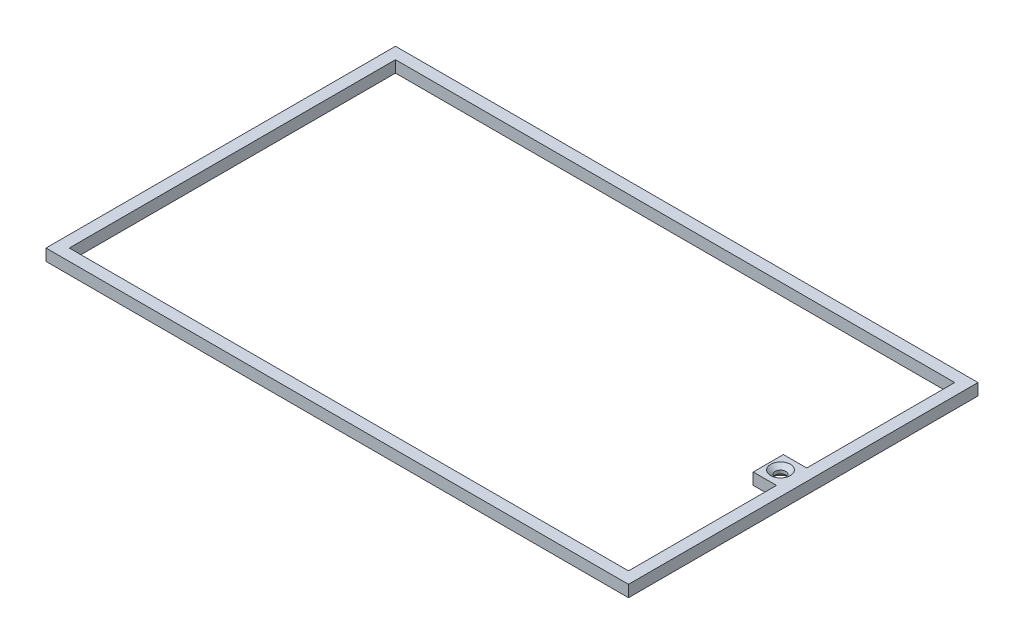
ISO-10303-21;
HEADER;
FILE_DESCRIPTION(('STEP AP214'),'2;1');
FILE_NAME('part.step','',(''),(''),'','','');
FILE_SCHEMA(('AUTOMOTIVE_DESIGN { 1 0 10303 214 1 1 1 1 }'));
ENDSEC;
DATA;
#1=APPLICATION_CONTEXT('core data for automotive mechanical design processes');
#2=APPLICATION_PROTOCOL_DEFINITION('international standard','automotive_design',2000,#1);
#3=PRODUCT_CONTEXT('',#1,'mechanical');
#4=PRODUCT('Part','Part','',(#3));
#5=PRODUCT_RELATED_PRODUCT_CATEGORY('part','',(#4));
#6=PRODUCT_DEFINITION_FORMATION('','',#4);
#7=PRODUCT_DEFINITION_CONTEXT('part definition',#1,'design');
#8=PRODUCT_DEFINITION('design','',#6,#7);
#9=PRODUCT_DEFINITION_SHAPE('','',#8);
#10=(LENGTH_UNIT() NAMED_UNIT(*) SI_UNIT(.MILLI.,.METRE.));
#11=(NAMED_UNIT(*) PLANE_ANGLE_UNIT() SI_UNIT($,.RADIAN.));
#12=(NAMED_UNIT(*) SI_UNIT($,.STERADIAN.) SOLID_ANGLE_UNIT());
#13=UNCERTAINTY_MEASURE_WITH_UNIT(LENGTH_MEASURE(1.E-05),#10,'distance_accuracy_value','');
#14=(GEOMETRIC_REPRESENTATION_CONTEXT(3) GLOBAL_UNCERTAINTY_ASSIGNED_CONTEXT((#13)) GLOBAL_UNIT_ASSIGNED_CONTEXT((#10,
#11,#12)) REPRESENTATION_CONTEXT('',''));
#15=CARTESIAN_POINT('',(0.,0.,0.));
#16=DIRECTION('',(0.,0.,1.));
#17=DIRECTION('',(1.,0.,0.));
#18=AXIS2_PLACEMENT_3D('',#15,#16,#17);
#19=CARTESIAN_POINT('',(0.,0.,0.));
#20=DIRECTION('',(0.,-1.,0.));
#21=DIRECTION('',(0.,0.,-1.));
#22=AXIS2_PLACEMENT_3D('',#19,#20,#21);
#23=PLANE('',#22);
#24=CARTESIAN_POINT('',(240.110859840816,0.,-75.1359923408761));
#25=DIRECTION('',(0.,-1.,0.));
#26=DIRECTION('',(0.,0.,-1.));
#27=AXIS2_PLACEMENT_3D('',#24,#25,#26);
#28=CIRCLE('',#27,4.24789999999994);
#29=CARTESIAN_POINT('',(240.110859840816,0.,-79.383892340876));
#30=VERTEX_POINT('',#29);
#31=EDGE_CURVE('E43',#30,#30,#28,.F.);
#32=ORIENTED_EDGE('',*,*,#31,.T.);
#33=EDGE_LOOP('',(#32));
#34=FACE_BOUND('',#33,.T.);
#35=DIRECTION('',(0.,0.,1.));
#36=VECTOR('',#35,1.);
#37=CARTESIAN_POINT('',(0.,0.,0.));
#38=LINE('',#37,#36);
#39=CARTESIAN_POINT('',(0.,0.,-150.));
#40=VERTEX_POINT('',#39);
#41=CARTESIAN_POINT('',(0.,0.,0.));
#42=VERTEX_POINT('',#41);
#43=EDGE_CURVE('E182',#40,#42,#38,.T.);
#44=ORIENTED_EDGE('',*,*,#43,.F.);
#45=DIRECTION('',(-1.,0.,0.));
#46=VECTOR('',#45,1.);
#47=CARTESIAN_POINT('',(0.,0.,-150.));
#48=LINE('',#47,#46);
#49=CARTESIAN_POINT('',(250.,0.,-150.));
#50=VERTEX_POINT('',#49);
#51=EDGE_CURVE('E198',#50,#40,#48,.T.);
#52=ORIENTED_EDGE('',*,*,#51,.F.);
#53=DIRECTION('',(0.,0.,-1.));
#54=VECTOR('',#53,1.);
#55=CARTESIAN_POINT('',(250.,0.,0.));
#56=LINE('',#55,#54);
#57=CARTESIAN_POINT('',(250.,0.,0.));
#58=VERTEX_POINT('',#57);
#59=EDGE_CURVE('E209',#58,#50,#56,.T.);
#60=ORIENTED_EDGE('',*,*,#59,.F.);
#61=DIRECTION('',(1.,0.,0.));
#62=VECTOR('',#61,1.);
#63=CARTESIAN_POINT('',(0.,0.,0.));
#64=LINE('',#63,#62);
#65=EDGE_CURVE('E207',#42,#58,#64,.T.);
#66=ORIENTED_EDGE('',*,*,#65,.F.);
#67=EDGE_LOOP('',(#44,#52,#60,#66));
#68=FACE_BOUND('',#67,.T.);
#69=DIRECTION('',(0.,0.,1.));
#70=VECTOR('',#69,1.);
#71=CARTESIAN_POINT('',(5.00000000000001,0.,-5.));
#72=LINE('',#71,#70);
#73=CARTESIAN_POINT('',(4.99999999999999,0.,-145.));
#74=VERTEX_POINT('',#73);
#75=CARTESIAN_POINT('',(5.00000000000001,0.,-5.));
#76=VERTEX_POINT('',#75);
#77=EDGE_CURVE('E126',#74,#76,#72,.T.);
#78=ORIENTED_EDGE('',*,*,#77,.T.);
#79=DIRECTION('',(1.,0.,0.));
#80=VECTOR('',#79,1.);
#81=CARTESIAN_POINT('',(5.00000000000001,0.,-5.));
#82=LINE('',#81,#80);
#83=CARTESIAN_POINT('',(245.,0.,-5.));
#84=VERTEX_POINT('',#83);
#85=EDGE_CURVE('E135',#76,#84,#82,.T.);
#86=ORIENTED_EDGE('',*,*,#85,.T.);
#87=DIRECTION('',(0.,0.,-1.));
#88=VECTOR('',#87,1.);
#89=CARTESIAN_POINT('',(245.,0.,-5.));
#90=LINE('',#89,#88);
#91=CARTESIAN_POINT('',(245.,0.,-68.5227089212575));
#92=VERTEX_POINT('',#91);
#93=EDGE_CURVE('E58',#84,#92,#90,.T.);
#94=ORIENTED_EDGE('',*,*,#93,.T.);
#95=DIRECTION('',(-1.,0.,0.));
#96=VECTOR('',#95,1.);
#97=CARTESIAN_POINT('',(235.,0.,-68.5227089212575));
#98=LINE('',#97,#96);
#99=CARTESIAN_POINT('',(235.,0.,-68.5227089212575));
#100=VERTEX_POINT('',#99);
#101=EDGE_CURVE('E151',#92,#100,#98,.T.);
#102=ORIENTED_EDGE('',*,*,#101,.T.);
#103=DIRECTION('',(0.,0.,-1.));
#104=VECTOR('',#103,1.);
#105=CARTESIAN_POINT('',(235.,0.,-81.4772910787425));
#106=LINE('',#105,#104);
#107=CARTESIAN_POINT('',(235.,0.,-81.4772910787425));
#108=VERTEX_POINT('',#107);
#109=EDGE_CURVE('E154',#100,#108,#106,.T.);
#110=ORIENTED_EDGE('',*,*,#109,.T.);
#111=DIRECTION('',(1.,0.,0.));
#112=VECTOR('',#111,1.);
#113=CARTESIAN_POINT('',(235.,0.,-81.4772910787425));
#114=LINE('',#113,#112);
#115=CARTESIAN_POINT('',(245.,0.,-81.4772910787425));
#116=VERTEX_POINT('',#115);
#117=EDGE_CURVE('E157',#108,#116,#114,.T.);
#118=ORIENTED_EDGE('',*,*,#117,.T.);
#119=DIRECTION('',(0.,0.,-1.));
#120=VECTOR('',#119,1.);
#121=CARTESIAN_POINT('',(245.,0.,-81.4772910787425));
#122=LINE('',#121,#120);
#123=CARTESIAN_POINT('',(245.,0.,-145.));
#124=VERTEX_POINT('',#123);
#125=EDGE_CURVE('E160',#116,#124,#122,.T.);
#126=ORIENTED_EDGE('',*,*,#125,.T.);
#127=DIRECTION('',(-1.,0.,0.));
#128=VECTOR('',#127,1.);
#129=CARTESIAN_POINT('',(4.99999999999999,0.,-145.));
#130=LINE('',#129,#128);
#131=EDGE_CURVE('E132',#124,#74,#130,.T.);
#132=ORIENTED_EDGE('',*,*,#131,.T.);
#133=EDGE_LOOP('',(#78,#86,#94,#102,#110,#118,#126,#132));
#134=FACE_BOUND('',#133,.T.);
#135=ADVANCED_FACE('F35',(#34,#68,#134),#23,.T.);
#136=CARTESIAN_POINT('',(0.,5.,0.));
#137=DIRECTION('',(0.,-1.,0.));
#138=DIRECTION('',(0.,0.,-1.));
#139=AXIS2_PLACEMENT_3D('',#136,#137,#138);
#140=PLANE('',#139);
#141=DIRECTION('',(1.,0.,0.));
#142=VECTOR('',#141,1.);
#143=CARTESIAN_POINT('',(5.00000000000001,5.,-5.));
#144=LINE('',#143,#142);
#145=CARTESIAN_POINT('',(5.00000000000001,5.,-5.));
#146=VERTEX_POINT('',#145);
#147=CARTESIAN_POINT('',(245.,5.,-5.));
#148=VERTEX_POINT('',#147);
#149=EDGE_CURVE('E164',#146,#148,#144,.T.);
#150=ORIENTED_EDGE('',*,*,#149,.F.);
#151=DIRECTION('',(0.,0.,1.));
#152=VECTOR('',#151,1.);
#153=CARTESIAN_POINT('',(5.00000000000001,5.,-5.));
#154=LINE('',#153,#152);
#155=CARTESIAN_POINT('',(4.99999999999999,5.,-145.));
#156=VERTEX_POINT('',#155);
#157=EDGE_CURVE('E50',#156,#146,#154,.T.);
#158=ORIENTED_EDGE('',*,*,#157,.F.);
#159=DIRECTION('',(-1.,0.,0.));
#160=VECTOR('',#159,1.);
#161=CARTESIAN_POINT('',(4.99999999999999,5.,-145.));
#162=LINE('',#161,#160);
#163=CARTESIAN_POINT('',(245.,5.,-145.));
#164=VERTEX_POINT('',#163);
#165=EDGE_CURVE('E141',#164,#156,#162,.T.);
#166=ORIENTED_EDGE('',*,*,#165,.F.);
#167=DIRECTION('',(0.,0.,-1.));
#168=VECTOR('',#167,1.);
#169=CARTESIAN_POINT('',(245.,5.,-81.4772910787425));
#170=LINE('',#169,#168);
#171=CARTESIAN_POINT('',(245.,5.,-81.4772910787425));
#172=VERTEX_POINT('',#171);
#173=EDGE_CURVE('E144',#172,#164,#170,.T.);
#174=ORIENTED_EDGE('',*,*,#173,.F.);
#175=DIRECTION('',(1.,0.,0.));
#176=VECTOR('',#175,1.);
#177=CARTESIAN_POINT('',(235.,5.,-81.4772910787425));
#178=LINE('',#177,#176);
#179=CARTESIAN_POINT('',(235.,5.,-81.4772910787425));
#180=VERTEX_POINT('',#179);
#181=EDGE_CURVE('E175',#180,#172,#178,.T.);
#182=ORIENTED_EDGE('',*,*,#181,.F.);
#183=DIRECTION('',(0.,0.,-1.));
#184=VECTOR('',#183,1.);
#185=CARTESIAN_POINT('',(235.,5.,-81.4772910787425));
#186=LINE('',#185,#184);
#187=CARTESIAN_POINT('',(235.,5.,-68.5227089212575));
#188=VERTEX_POINT('',#187);
#189=EDGE_CURVE('E172',#188,#180,#186,.T.);
#190=ORIENTED_EDGE('',*,*,#189,.F.);
#191=DIRECTION('',(-1.,0.,0.));
#192=VECTOR('',#191,1.);
#193=CARTESIAN_POINT('',(235.,5.,-68.5227089212575));
#194=LINE('',#193,#192);
#195=CARTESIAN_POINT('',(245.,5.,-68.5227089212575));
#196=VERTEX_POINT('',#195);
#197=EDGE_CURVE('E169',#196,#188,#194,.T.);
#198=ORIENTED_EDGE('',*,*,#197,.F.);
#199=DIRECTION('',(0.,0.,-1.));
#200=VECTOR('',#199,1.);
#201=CARTESIAN_POINT('',(245.,5.,-5.));
#202=LINE('',#201,#200);
#203=EDGE_CURVE('E166',#148,#196,#202,.T.);
#204=ORIENTED_EDGE('',*,*,#203,.F.);
#205=EDGE_LOOP('',(#150,#158,#166,#174,#182,#190,#198,#204));
#206=FACE_BOUND('',#205,.T.);
#207=DIRECTION('',(0.,0.,1.));
#208=VECTOR('',#207,1.);
#209=CARTESIAN_POINT('',(0.,5.,0.));
#210=LINE('',#209,#208);
#211=CARTESIAN_POINT('',(0.,5.,-150.));
#212=VERTEX_POINT('',#211);
#213=CARTESIAN_POINT('',(0.,5.,0.));
#214=VERTEX_POINT('',#213);
#215=EDGE_CURVE('E194',#212,#214,#210,.T.);
#216=ORIENTED_EDGE('',*,*,#215,.T.);
#217=DIRECTION('',(1.,0.,0.));
#218=VECTOR('',#217,1.);
#219=CARTESIAN_POINT('',(0.,5.,0.));
#220=LINE('',#219,#218);
#221=CARTESIAN_POINT('',(250.,5.,0.));
#222=VERTEX_POINT('',#221);
#223=EDGE_CURVE('E197',#214,#222,#220,.T.);
#224=ORIENTED_EDGE('',*,*,#223,.T.);
#225=DIRECTION('',(0.,0.,-1.));
#226=VECTOR('',#225,1.);
#227=CARTESIAN_POINT('',(250.,5.,0.));
#228=LINE('',#227,#226);
#229=CARTESIAN_POINT('',(250.,5.,-150.));
#230=VERTEX_POINT('',#229);
#231=EDGE_CURVE('E200',#222,#230,#228,.T.);
#232=ORIENTED_EDGE('',*,*,#231,.T.);
#233=DIRECTION('',(-1.,0.,0.));
#234=VECTOR('',#233,1.);
#235=CARTESIAN_POINT('',(0.,5.,-150.));
#236=LINE('',#235,#234);
#237=EDGE_CURVE('E202',#230,#212,#236,.T.);
#238=ORIENTED_EDGE('',*,*,#237,.T.);
#239=EDGE_LOOP('',(#216,#224,#232,#238));
#240=FACE_BOUND('',#239,.T.);
#241=CARTESIAN_POINT('',(240.110859840816,5.,-75.1359923408761));
#242=DIRECTION('',(0.,1.,0.));
#243=DIRECTION('',(0.,0.,1.));
#244=AXIS2_PLACEMENT_3D('',#241,#242,#243);
#245=CIRCLE('',#244,4.21640000000001);
#246=CARTESIAN_POINT('',(240.110859840816,5.,-70.9195923408761));
#247=VERTEX_POINT('',#246);
#248=EDGE_CURVE('E279',#247,#247,#245,.T.);
#249=ORIENTED_EDGE('',*,*,#248,.F.);
#250=EDGE_LOOP('',(#249));
#251=FACE_BOUND('',#250,.T.);
#252=ADVANCED_FACE('F238',(#206,#240,#251),#140,.F.);
#253=CARTESIAN_POINT('',(0.,5.,0.));
#254=DIRECTION('',(1.,0.,0.));
#255=DIRECTION('',(0.,0.,-1.));
#256=AXIS2_PLACEMENT_3D('',#253,#254,#255);
#257=PLANE('',#256);
#258=ORIENTED_EDGE('',*,*,#43,.T.);
#259=DIRECTION('',(0.,-1.,0.));
#260=VECTOR('',#259,1.);
#261=CARTESIAN_POINT('',(0.,5.,0.));
#262=LINE('',#261,#260);
#263=EDGE_CURVE('E220',#214,#42,#262,.T.);
#264=ORIENTED_EDGE('',*,*,#263,.F.);
#265=ORIENTED_EDGE('',*,*,#215,.F.);
#266=DIRECTION('',(0.,-1.,0.));
#267=VECTOR('',#266,1.);
#268=CARTESIAN_POINT('',(0.,5.,-150.));
#269=LINE('',#268,#267);
#270=EDGE_CURVE('E204',#212,#40,#269,.T.);
#271=ORIENTED_EDGE('',*,*,#270,.T.);
#272=EDGE_LOOP('',(#258,#264,#265,#271));
#273=FACE_BOUND('',#272,.T.);
#274=ADVANCED_FACE('F245',(#273),#257,.F.);
#275=CARTESIAN_POINT('',(0.,5.,0.));
#276=DIRECTION('',(0.,0.,-1.));
#277=DIRECTION('',(-1.,0.,0.));
#278=AXIS2_PLACEMENT_3D('',#275,#276,#277);
#279=PLANE('',#278);
#280=ORIENTED_EDGE('',*,*,#65,.T.);
#281=DIRECTION('',(0.,-1.,0.));
#282=VECTOR('',#281,1.);
#283=CARTESIAN_POINT('',(250.,5.,0.));
#284=LINE('',#283,#282);
#285=EDGE_CURVE('E217',#222,#58,#284,.T.);
#286=ORIENTED_EDGE('',*,*,#285,.F.);
#287=ORIENTED_EDGE('',*,*,#223,.F.);
#288=ORIENTED_EDGE('',*,*,#263,.T.);
#289=EDGE_LOOP('',(#280,#286,#287,#288));
#290=FACE_BOUND('',#289,.T.);
#291=ADVANCED_FACE('F257',(#290),#279,.F.);
#292=CARTESIAN_POINT('',(250.,5.,0.));
#293=DIRECTION('',(-1.,0.,0.));
#294=DIRECTION('',(0.,0.,1.));
#295=AXIS2_PLACEMENT_3D('',#292,#293,#294);
#296=PLANE('',#295);
#297=ORIENTED_EDGE('',*,*,#59,.T.);
#298=DIRECTION('',(0.,-1.,0.));
#299=VECTOR('',#298,1.);
#300=CARTESIAN_POINT('',(250.,5.,-150.));
#301=LINE('',#300,#299);
#302=EDGE_CURVE('E214',#230,#50,#301,.T.);
#303=ORIENTED_EDGE('',*,*,#302,.F.);
#304=ORIENTED_EDGE('',*,*,#231,.F.);
#305=ORIENTED_EDGE('',*,*,#285,.T.);
#306=EDGE_LOOP('',(#297,#303,#304,#305));
#307=FACE_BOUND('',#306,.T.);
#308=ADVANCED_FACE('F253',(#307),#296,.F.);
#309=CARTESIAN_POINT('',(0.,5.,-150.));
#310=DIRECTION('',(0.,0.,1.));
#311=DIRECTION('',(1.,0.,0.));
#312=AXIS2_PLACEMENT_3D('',#309,#310,#311);
#313=PLANE('',#312);
#314=ORIENTED_EDGE('',*,*,#51,.T.);
#315=ORIENTED_EDGE('',*,*,#270,.F.);
#316=ORIENTED_EDGE('',*,*,#237,.F.);
#317=ORIENTED_EDGE('',*,*,#302,.T.);
#318=EDGE_LOOP('',(#314,#315,#316,#317));
#319=FACE_BOUND('',#318,.T.);
#320=ADVANCED_FACE('F250',(#319),#313,.F.);
#321=CARTESIAN_POINT('',(5.00000000000001,0.,-5.));
#322=DIRECTION('',(-1.,0.,0.));
#323=DIRECTION('',(0.,0.,1.));
#324=AXIS2_PLACEMENT_3D('',#321,#322,#323);
#325=PLANE('',#324);
#326=ORIENTED_EDGE('',*,*,#157,.T.);
#327=DIRECTION('',(0.,1.,0.));
#328=VECTOR('',#327,1.);
#329=CARTESIAN_POINT('',(5.00000000000001,0.,-5.));
#330=LINE('',#329,#328);
#331=EDGE_CURVE('E122',#76,#146,#330,.T.);
#332=ORIENTED_EDGE('',*,*,#331,.F.);
#333=ORIENTED_EDGE('',*,*,#77,.F.);
#334=DIRECTION('',(0.,1.,0.));
#335=VECTOR('',#334,1.);
#336=CARTESIAN_POINT('',(4.99999999999999,0.,-145.));
#337=LINE('',#336,#335);
#338=EDGE_CURVE('E180',#74,#156,#337,.T.);
#339=ORIENTED_EDGE('',*,*,#338,.T.);
#340=EDGE_LOOP('',(#326,#332,#333,#339));
#341=FACE_BOUND('',#340,.T.);
#342=ADVANCED_FACE('F124',(#341),#325,.F.);
#343=CARTESIAN_POINT('',(4.99999999999999,0.,-145.));
#344=DIRECTION('',(0.,0.,-1.));
#345=DIRECTION('',(-1.,0.,0.));
#346=AXIS2_PLACEMENT_3D('',#343,#344,#345);
#347=PLANE('',#346);
#348=ORIENTED_EDGE('',*,*,#165,.T.);
#349=ORIENTED_EDGE('',*,*,#338,.F.);
#350=ORIENTED_EDGE('',*,*,#131,.F.);
#351=DIRECTION('',(0.,1.,0.));
#352=VECTOR('',#351,1.);
#353=CARTESIAN_POINT('',(245.,0.,-145.));
#354=LINE('',#353,#352);
#355=EDGE_CURVE('E183',#124,#164,#354,.T.);
#356=ORIENTED_EDGE('',*,*,#355,.T.);
#357=EDGE_LOOP('',(#348,#349,#350,#356));
#358=FACE_BOUND('',#357,.T.);
#359=ADVANCED_FACE('F292',(#358),#347,.F.);
#360=CARTESIAN_POINT('',(245.,0.,-81.4772910787425));
#361=DIRECTION('',(1.,0.,0.));
#362=DIRECTION('',(0.,0.,-1.));
#363=AXIS2_PLACEMENT_3D('',#360,#361,#362);
#364=PLANE('',#363);
#365=ORIENTED_EDGE('',*,*,#173,.T.);
#366=ORIENTED_EDGE('',*,*,#355,.F.);
#367=ORIENTED_EDGE('',*,*,#125,.F.);
#368=DIRECTION('',(0.,1.,0.));
#369=VECTOR('',#368,1.);
#370=CARTESIAN_POINT('',(245.,0.,-81.4772910787425));
#371=LINE('',#370,#369);
#372=EDGE_CURVE('E185',#116,#172,#371,.T.);
#373=ORIENTED_EDGE('',*,*,#372,.T.);
#374=EDGE_LOOP('',(#365,#366,#367,#373));
#375=FACE_BOUND('',#374,.T.);
#376=ADVANCED_FACE('F295',(#375),#364,.F.);
#377=CARTESIAN_POINT('',(235.,0.,-81.4772910787425));
#378=DIRECTION('',(0.,0.,1.));
#379=DIRECTION('',(1.,0.,0.));
#380=AXIS2_PLACEMENT_3D('',#377,#378,#379);
#381=PLANE('',#380);
#382=ORIENTED_EDGE('',*,*,#181,.T.);
#383=ORIENTED_EDGE('',*,*,#372,.F.);
#384=ORIENTED_EDGE('',*,*,#117,.F.);
#385=DIRECTION('',(0.,1.,0.));
#386=VECTOR('',#385,1.);
#387=CARTESIAN_POINT('',(235.,0.,-81.4772910787425));
#388=LINE('',#387,#386);
#389=EDGE_CURVE('E187',#108,#180,#388,.T.);
#390=ORIENTED_EDGE('',*,*,#389,.T.);
#391=EDGE_LOOP('',(#382,#383,#384,#390));
#392=FACE_BOUND('',#391,.T.);
#393=ADVANCED_FACE('F299',(#392),#381,.F.);
#394=CARTESIAN_POINT('',(235.,0.,-81.4772910787425));
#395=DIRECTION('',(1.,0.,0.));
#396=DIRECTION('',(0.,0.,-1.));
#397=AXIS2_PLACEMENT_3D('',#394,#395,#396);
#398=PLANE('',#397);
#399=ORIENTED_EDGE('',*,*,#189,.T.);
#400=ORIENTED_EDGE('',*,*,#389,.F.);
#401=ORIENTED_EDGE('',*,*,#109,.F.);
#402=DIRECTION('',(0.,1.,0.));
#403=VECTOR('',#402,1.);
#404=CARTESIAN_POINT('',(235.,0.,-68.5227089212575));
#405=LINE('',#404,#403);
#406=EDGE_CURVE('E189',#100,#188,#405,.T.);
#407=ORIENTED_EDGE('',*,*,#406,.T.);
#408=EDGE_LOOP('',(#399,#400,#401,#407));
#409=FACE_BOUND('',#408,.T.);
#410=ADVANCED_FACE('F303',(#409),#398,.F.);
#411=CARTESIAN_POINT('',(235.,0.,-68.5227089212575));
#412=DIRECTION('',(0.,0.,-1.));
#413=DIRECTION('',(-1.,0.,0.));
#414=AXIS2_PLACEMENT_3D('',#411,#412,#413);
#415=PLANE('',#414);
#416=ORIENTED_EDGE('',*,*,#197,.T.);
#417=ORIENTED_EDGE('',*,*,#406,.F.);
#418=ORIENTED_EDGE('',*,*,#101,.F.);
#419=DIRECTION('',(0.,1.,0.));
#420=VECTOR('',#419,1.);
#421=CARTESIAN_POINT('',(245.,0.,-68.5227089212575));
#422=LINE('',#421,#420);
#423=EDGE_CURVE('E191',#92,#196,#422,.T.);
#424=ORIENTED_EDGE('',*,*,#423,.T.);
#425=EDGE_LOOP('',(#416,#417,#418,#424));
#426=FACE_BOUND('',#425,.T.);
#427=ADVANCED_FACE('F307',(#426),#415,.F.);
#428=CARTESIAN_POINT('',(245.,0.,-5.));
#429=DIRECTION('',(1.,0.,0.));
#430=DIRECTION('',(0.,0.,-1.));
#431=AXIS2_PLACEMENT_3D('',#428,#429,#430);
#432=PLANE('',#431);
#433=ORIENTED_EDGE('',*,*,#203,.T.);
#434=ORIENTED_EDGE('',*,*,#423,.F.);
#435=ORIENTED_EDGE('',*,*,#93,.F.);
#436=DIRECTION('',(0.,1.,0.));
#437=VECTOR('',#436,1.);
#438=CARTESIAN_POINT('',(245.,0.,-5.));
#439=LINE('',#438,#437);
#440=EDGE_CURVE('E131',#84,#148,#439,.T.);
#441=ORIENTED_EDGE('',*,*,#440,.T.);
#442=EDGE_LOOP('',(#433,#434,#435,#441));
#443=FACE_BOUND('',#442,.T.);
#444=ADVANCED_FACE('F289',(#443),#432,.F.);
#445=CARTESIAN_POINT('',(5.00000000000001,0.,-5.));
#446=DIRECTION('',(0.,0.,1.));
#447=DIRECTION('',(1.,0.,0.));
#448=AXIS2_PLACEMENT_3D('',#445,#446,#447);
#449=PLANE('',#448);
#450=ORIENTED_EDGE('',*,*,#149,.T.);
#451=ORIENTED_EDGE('',*,*,#440,.F.);
#452=ORIENTED_EDGE('',*,*,#85,.F.);
#453=ORIENTED_EDGE('',*,*,#331,.T.);
#454=EDGE_LOOP('',(#450,#451,#452,#453));
#455=FACE_BOUND('',#454,.T.);
#456=ADVANCED_FACE('F136',(#455),#449,.F.);
#457=CARTESIAN_POINT('',(240.110859840816,5.,-75.1359923408761));
#458=DIRECTION('',(0.,1.,0.));
#459=DIRECTION('',(0.,0.,1.));
#460=AXIS2_PLACEMENT_3D('',#457,#458,#459);
#461=CYLINDRICAL_SURFACE('',#460,2.2479);
#462=CARTESIAN_POINT('',(240.110859840816,1.99999999999995,-75.1359923408761));
#463=DIRECTION('',(0.,-1.,0.));
#464=DIRECTION('',(0.,0.,-1.));
#465=AXIS2_PLACEMENT_3D('',#462,#463,#464);
#466=CIRCLE('',#465,2.2479);
#467=CARTESIAN_POINT('',(240.110859840816,1.99999999999995,-77.3838923408761));
#468=VERTEX_POINT('',#467);
#469=EDGE_CURVE('E11',#468,#468,#466,.T.);
#470=ORIENTED_EDGE('',*,*,#469,.T.);
#471=EDGE_LOOP('',(#470));
#472=FACE_BOUND('',#471,.T.);
#473=CARTESIAN_POINT('',(240.110859840816,3.34823237602752,-75.1359923408761));
#474=DIRECTION('',(0.,1.,0.));
#475=DIRECTION('',(0.,0.,1.));
#476=AXIS2_PLACEMENT_3D('',#473,#474,#475);
#477=CIRCLE('',#476,2.2479);
#478=CARTESIAN_POINT('',(240.110859840816,3.34823237602752,-72.8880923408761));
#479=VERTEX_POINT('',#478);
#480=EDGE_CURVE('E147',#479,#479,#477,.T.);
#481=ORIENTED_EDGE('',*,*,#480,.T.);
#482=EDGE_LOOP('',(#481));
#483=FACE_BOUND('',#482,.T.);
#484=ADVANCED_FACE('F233',(#472,#483),#461,.F.);
#485=CARTESIAN_POINT('',(240.110859840816,5.,-75.1359923408761));
#486=DIRECTION('',(0.,1.,0.));
#487=DIRECTION('',(0.,0.,1.));
#488=AXIS2_PLACEMENT_3D('',#485,#486,#487);
#489=CONICAL_SURFACE('',#488,4.21640000000001,0.872664625997167);
#490=ORIENTED_EDGE('',*,*,#480,.F.);
#491=EDGE_LOOP('',(#490));
#492=FACE_BOUND('',#491,.T.);
#493=ORIENTED_EDGE('',*,*,#248,.T.);
#494=EDGE_LOOP('',(#493));
#495=FACE_BOUND('',#494,.T.);
#496=ADVANCED_FACE('F228',(#492,#495),#489,.F.);
#497=CARTESIAN_POINT('',(240.110859840816,0.,-75.1359923408761));
#498=DIRECTION('',(0.,-1.,0.));
#499=DIRECTION('',(0.,0.,-1.));
#500=AXIS2_PLACEMENT_3D('',#497,#498,#499);
#501=CONICAL_SURFACE('',#500,4.24789999999994,0.785398163397447);
#502=ORIENTED_EDGE('',*,*,#469,.F.);
#503=EDGE_LOOP('',(#502));
#504=FACE_BOUND('',#503,.T.);
#505=ORIENTED_EDGE('',*,*,#31,.F.);
#506=EDGE_LOOP('',(#505));
#507=FACE_BOUND('',#506,.T.);
#508=ADVANCED_FACE('F37',(#504,#507),#501,.F.);
#509=CLOSED_SHELL('',(#135,#252,#274,#291,#308,#320,#342,#359,#376,#393,#410,#427,#444,#456,
#484,#496,#508));
#510=MANIFOLD_SOLID_BREP('B2',#509);
#511=ADVANCED_BREP_SHAPE_REPRESENTATION('',(#18,#510),#14);
#512=SHAPE_DEFINITION_REPRESENTATION(#9,#511);
ENDSEC;
END-ISO-10303-21;
